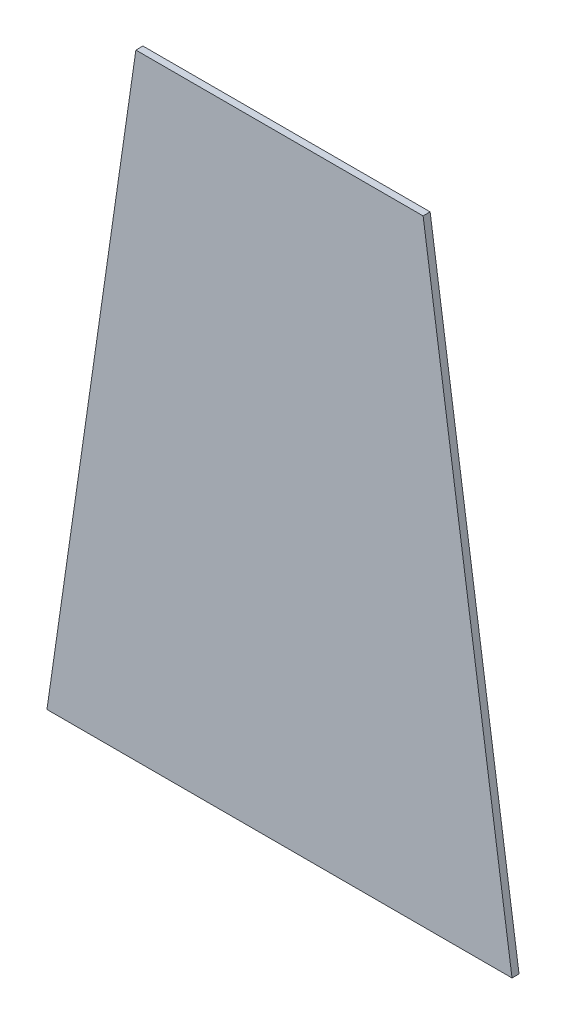
ISO-10303-21;
HEADER;
FILE_DESCRIPTION(('STEP AP214'),'2;1');
FILE_NAME('part.step','',(''),(''),'','','');
FILE_SCHEMA(('AUTOMOTIVE_DESIGN { 1 0 10303 214 1 1 1 1 }'));
ENDSEC;
DATA;
#1=APPLICATION_CONTEXT('core data for automotive mechanical design processes');
#2=APPLICATION_PROTOCOL_DEFINITION('international standard','automotive_design',2000,#1);
#3=PRODUCT_CONTEXT('',#1,'mechanical');
#4=PRODUCT('Part','Part','',(#3));
#5=PRODUCT_RELATED_PRODUCT_CATEGORY('part','',(#4));
#6=PRODUCT_DEFINITION_FORMATION('','',#4);
#7=PRODUCT_DEFINITION_CONTEXT('part definition',#1,'design');
#8=PRODUCT_DEFINITION('design','',#6,#7);
#9=PRODUCT_DEFINITION_SHAPE('','',#8);
#10=(LENGTH_UNIT() NAMED_UNIT(*) SI_UNIT(.MILLI.,.METRE.));
#11=(NAMED_UNIT(*) PLANE_ANGLE_UNIT() SI_UNIT($,.RADIAN.));
#12=(NAMED_UNIT(*) SI_UNIT($,.STERADIAN.) SOLID_ANGLE_UNIT());
#13=UNCERTAINTY_MEASURE_WITH_UNIT(LENGTH_MEASURE(1.E-05),#10,'distance_accuracy_value','');
#14=(GEOMETRIC_REPRESENTATION_CONTEXT(3) GLOBAL_UNCERTAINTY_ASSIGNED_CONTEXT((#13)) GLOBAL_UNIT_ASSIGNED_CONTEXT((#10,
#11,#12)) REPRESENTATION_CONTEXT('',''));
#15=CARTESIAN_POINT('',(0.,0.,0.));
#16=DIRECTION('',(0.,0.,1.));
#17=DIRECTION('',(1.,0.,0.));
#18=AXIS2_PLACEMENT_3D('',#15,#16,#17);
#19=CARTESIAN_POINT('',(-85.5280263635264,12.3540482525093,3.2639));
#20=DIRECTION('',(0.989728356843954,-0.142960762655237,0.));
#21=DIRECTION('',(0.142960762655237,0.989728356843954,0.));
#22=AXIS2_PLACEMENT_3D('',#19,#20,#21);
#23=PLANE('',#22);
#24=DIRECTION('',(-0.142960762655237,-0.989728356843954,0.));
#25=VECTOR('',#24,1.);
#26=CARTESIAN_POINT('',(-85.5280263635264,12.3540482525093,0.));
#27=LINE('',#26,#25);
#28=CARTESIAN_POINT('',(-66.675,142.875,0.));
#29=VERTEX_POINT('',#28);
#30=CARTESIAN_POINT('',(-107.95,-142.875,0.));
#31=VERTEX_POINT('',#30);
#32=EDGE_CURVE('E129',#29,#31,#27,.T.);
#33=ORIENTED_EDGE('',*,*,#32,.T.);
#34=DIRECTION('',(0.,0.,-1.));
#35=VECTOR('',#34,1.);
#36=CARTESIAN_POINT('',(-107.95,-142.875,3.2639));
#37=LINE('',#36,#35);
#38=CARTESIAN_POINT('',(-107.95,-142.875,3.2639));
#39=VERTEX_POINT('',#38);
#40=EDGE_CURVE('E12',#39,#31,#37,.T.);
#41=ORIENTED_EDGE('',*,*,#40,.F.);
#42=DIRECTION('',(-0.142960762655237,-0.989728356843954,0.));
#43=VECTOR('',#42,1.);
#44=CARTESIAN_POINT('',(-85.5280263635264,12.3540482525093,3.2639));
#45=LINE('',#44,#43);
#46=CARTESIAN_POINT('',(-66.675,142.875,3.2639));
#47=VERTEX_POINT('',#46);
#48=EDGE_CURVE('E96',#47,#39,#45,.T.);
#49=ORIENTED_EDGE('',*,*,#48,.F.);
#50=DIRECTION('',(0.,0.,-1.));
#51=VECTOR('',#50,1.);
#52=CARTESIAN_POINT('',(-66.675,142.875,3.2639));
#53=LINE('',#52,#51);
#54=EDGE_CURVE('E108',#47,#29,#53,.T.);
#55=ORIENTED_EDGE('',*,*,#54,.T.);
#56=EDGE_LOOP('',(#33,#41,#49,#55));
#57=FACE_BOUND('',#56,.T.);
#58=ADVANCED_FACE('F44',(#57),#23,.F.);
#59=CARTESIAN_POINT('',(0.,-142.875,3.2639));
#60=DIRECTION('',(0.,1.,0.));
#61=DIRECTION('',(0.,0.,1.));
#62=AXIS2_PLACEMENT_3D('',#59,#60,#61);
#63=PLANE('',#62);
#64=DIRECTION('',(1.,0.,0.));
#65=VECTOR('',#64,1.);
#66=CARTESIAN_POINT('',(0.,-142.875,0.));
#67=LINE('',#66,#65);
#68=CARTESIAN_POINT('',(107.95,-142.875,0.));
#69=VERTEX_POINT('',#68);
#70=EDGE_CURVE('E101',#31,#69,#67,.T.);
#71=ORIENTED_EDGE('',*,*,#70,.T.);
#72=DIRECTION('',(0.,0.,-1.));
#73=VECTOR('',#72,1.);
#74=CARTESIAN_POINT('',(107.95,-142.875,3.2639));
#75=LINE('',#74,#73);
#76=CARTESIAN_POINT('',(107.95,-142.875,3.2639));
#77=VERTEX_POINT('',#76);
#78=EDGE_CURVE('E53',#77,#69,#75,.T.);
#79=ORIENTED_EDGE('',*,*,#78,.F.);
#80=DIRECTION('',(1.,0.,0.));
#81=VECTOR('',#80,1.);
#82=CARTESIAN_POINT('',(0.,-142.875,3.2639));
#83=LINE('',#82,#81);
#84=EDGE_CURVE('E91',#39,#77,#83,.T.);
#85=ORIENTED_EDGE('',*,*,#84,.F.);
#86=ORIENTED_EDGE('',*,*,#40,.T.);
#87=EDGE_LOOP('',(#71,#79,#85,#86));
#88=FACE_BOUND('',#87,.T.);
#89=ADVANCED_FACE('F100',(#88),#63,.F.);
#90=CARTESIAN_POINT('',(85.5280263635265,12.3540482525094,3.2639));
#91=DIRECTION('',(-0.989728356843954,-0.142960762655238,0.));
#92=DIRECTION('',(0.142960762655238,-0.989728356843954,0.));
#93=AXIS2_PLACEMENT_3D('',#90,#91,#92);
#94=PLANE('',#93);
#95=DIRECTION('',(-0.142960762655238,0.989728356843954,0.));
#96=VECTOR('',#95,1.);
#97=CARTESIAN_POINT('',(85.5280263635265,12.3540482525094,0.));
#98=LINE('',#97,#96);
#99=CARTESIAN_POINT('',(66.675,142.875,0.));
#100=VERTEX_POINT('',#99);
#101=EDGE_CURVE('E78',#69,#100,#98,.T.);
#102=ORIENTED_EDGE('',*,*,#101,.T.);
#103=DIRECTION('',(0.,0.,-1.));
#104=VECTOR('',#103,1.);
#105=CARTESIAN_POINT('',(66.675,142.875,3.2639));
#106=LINE('',#105,#104);
#107=CARTESIAN_POINT('',(66.675,142.875,3.2639));
#108=VERTEX_POINT('',#107);
#109=EDGE_CURVE('E103',#108,#100,#106,.T.);
#110=ORIENTED_EDGE('',*,*,#109,.F.);
#111=DIRECTION('',(-0.142960762655238,0.989728356843954,0.));
#112=VECTOR('',#111,1.);
#113=CARTESIAN_POINT('',(85.5280263635265,12.3540482525094,3.2639));
#114=LINE('',#113,#112);
#115=EDGE_CURVE('E94',#77,#108,#114,.T.);
#116=ORIENTED_EDGE('',*,*,#115,.F.);
#117=ORIENTED_EDGE('',*,*,#78,.T.);
#118=EDGE_LOOP('',(#102,#110,#116,#117));
#119=FACE_BOUND('',#118,.T.);
#120=ADVANCED_FACE('F104',(#119),#94,.F.);
#121=CARTESIAN_POINT('',(0.,142.875,3.2639));
#122=DIRECTION('',(0.,-1.,0.));
#123=DIRECTION('',(0.,0.,-1.));
#124=AXIS2_PLACEMENT_3D('',#121,#122,#123);
#125=PLANE('',#124);
#126=DIRECTION('',(-1.,0.,0.));
#127=VECTOR('',#126,1.);
#128=CARTESIAN_POINT('',(0.,142.875,0.));
#129=LINE('',#128,#127);
#130=EDGE_CURVE('E84',#100,#29,#129,.T.);
#131=ORIENTED_EDGE('',*,*,#130,.T.);
#132=ORIENTED_EDGE('',*,*,#54,.F.);
#133=DIRECTION('',(-1.,0.,0.));
#134=VECTOR('',#133,1.);
#135=CARTESIAN_POINT('',(0.,142.875,3.2639));
#136=LINE('',#135,#134);
#137=EDGE_CURVE('E61',#108,#47,#136,.T.);
#138=ORIENTED_EDGE('',*,*,#137,.F.);
#139=ORIENTED_EDGE('',*,*,#109,.T.);
#140=EDGE_LOOP('',(#131,#132,#138,#139));
#141=FACE_BOUND('',#140,.T.);
#142=ADVANCED_FACE('F124',(#141),#125,.F.);
#143=CARTESIAN_POINT('',(0.,0.,3.2639));
#144=DIRECTION('',(0.,0.,1.));
#145=DIRECTION('',(1.,0.,0.));
#146=AXIS2_PLACEMENT_3D('',#143,#144,#145);
#147=PLANE('',#146);
#148=ORIENTED_EDGE('',*,*,#48,.T.);
#149=ORIENTED_EDGE('',*,*,#84,.T.);
#150=ORIENTED_EDGE('',*,*,#115,.T.);
#151=ORIENTED_EDGE('',*,*,#137,.T.);
#152=EDGE_LOOP('',(#148,#149,#150,#151));
#153=FACE_BOUND('',#152,.T.);
#154=ADVANCED_FACE('F92',(#153),#147,.T.);
#155=CARTESIAN_POINT('',(0.,0.,0.));
#156=DIRECTION('',(0.,0.,1.));
#157=DIRECTION('',(1.,0.,0.));
#158=AXIS2_PLACEMENT_3D('',#155,#156,#157);
#159=PLANE('',#158);
#160=ORIENTED_EDGE('',*,*,#32,.F.);
#161=ORIENTED_EDGE('',*,*,#130,.F.);
#162=ORIENTED_EDGE('',*,*,#101,.F.);
#163=ORIENTED_EDGE('',*,*,#70,.F.);
#164=EDGE_LOOP('',(#160,#161,#162,#163));
#165=FACE_BOUND('',#164,.T.);
#166=ADVANCED_FACE('F127',(#165),#159,.F.);
#167=CLOSED_SHELL('',(#58,#89,#120,#142,#154,#166));
#168=MANIFOLD_SOLID_BREP('B2',#167);
#169=ADVANCED_BREP_SHAPE_REPRESENTATION('',(#18,#168),#14);
#170=SHAPE_DEFINITION_REPRESENTATION(#9,#169);
ENDSEC;
END-ISO-10303-21;
